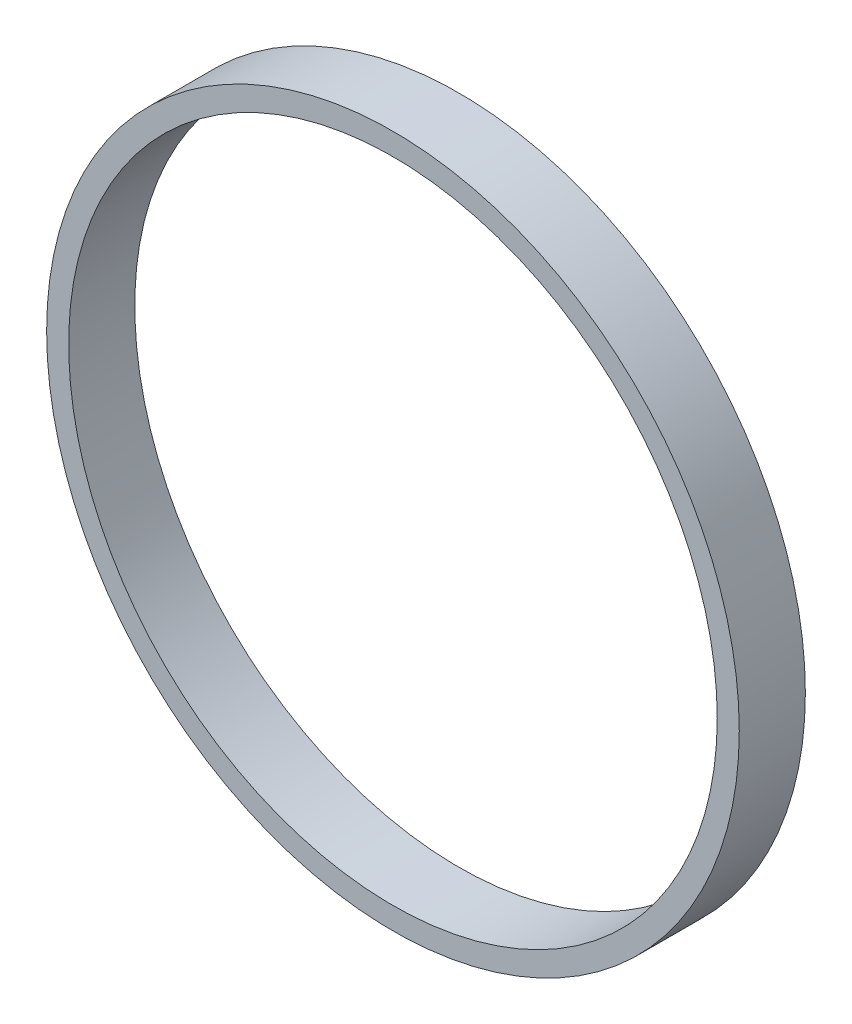
ISO-10303-21;
HEADER;
FILE_DESCRIPTION(('STEP AP214'),'2;1');
FILE_NAME('part.step','',(''),(''),'','','');
FILE_SCHEMA(('AUTOMOTIVE_DESIGN { 1 0 10303 214 1 1 1 1 }'));
ENDSEC;
DATA;
#1=APPLICATION_CONTEXT('core data for automotive mechanical design processes');
#2=APPLICATION_PROTOCOL_DEFINITION('international standard','automotive_design',2000,#1);
#3=PRODUCT_CONTEXT('',#1,'mechanical');
#4=PRODUCT('Part','Part','',(#3));
#5=PRODUCT_RELATED_PRODUCT_CATEGORY('part','',(#4));
#6=PRODUCT_DEFINITION_FORMATION('','',#4);
#7=PRODUCT_DEFINITION_CONTEXT('part definition',#1,'design');
#8=PRODUCT_DEFINITION('design','',#6,#7);
#9=PRODUCT_DEFINITION_SHAPE('','',#8);
#10=(LENGTH_UNIT() NAMED_UNIT(*) SI_UNIT(.MILLI.,.METRE.));
#11=(NAMED_UNIT(*) PLANE_ANGLE_UNIT() SI_UNIT($,.RADIAN.));
#12=(NAMED_UNIT(*) SI_UNIT($,.STERADIAN.) SOLID_ANGLE_UNIT());
#13=UNCERTAINTY_MEASURE_WITH_UNIT(LENGTH_MEASURE(1.E-05),#10,'distance_accuracy_value','');
#14=(GEOMETRIC_REPRESENTATION_CONTEXT(3) GLOBAL_UNCERTAINTY_ASSIGNED_CONTEXT((#13)) GLOBAL_UNIT_ASSIGNED_CONTEXT((#10,
#11,#12)) REPRESENTATION_CONTEXT('',''));
#15=CARTESIAN_POINT('',(0.,0.,0.));
#16=DIRECTION('',(0.,0.,1.));
#17=DIRECTION('',(1.,0.,0.));
#18=AXIS2_PLACEMENT_3D('',#15,#16,#17);
#19=CARTESIAN_POINT('',(0.,0.,4.7625));
#20=DIRECTION('',(0.,0.,1.));
#21=DIRECTION('',(1.,0.,0.));
#22=AXIS2_PLACEMENT_3D('',#19,#20,#21);
#23=PLANE('',#22);
#24=CARTESIAN_POINT('',(0.,0.,4.7625));
#25=DIRECTION('',(0.,0.,1.));
#26=DIRECTION('',(1.,0.,0.));
#27=AXIS2_PLACEMENT_3D('',#24,#25,#26);
#28=CIRCLE('',#27,24.9555);
#29=CARTESIAN_POINT('',(24.9555,0.,4.7625));
#30=VERTEX_POINT('',#29);
#31=EDGE_CURVE('E10',#30,#30,#28,.T.);
#32=ORIENTED_EDGE('',*,*,#31,.T.);
#33=EDGE_LOOP('',(#32));
#34=FACE_BOUND('',#33,.T.);
#35=CARTESIAN_POINT('',(0.,0.,4.7625));
#36=DIRECTION('',(0.,0.,1.));
#37=DIRECTION('',(1.,0.,0.));
#38=AXIS2_PLACEMENT_3D('',#35,#36,#37);
#39=CIRCLE('',#38,23.368);
#40=CARTESIAN_POINT('',(23.368,0.,4.7625));
#41=VERTEX_POINT('',#40);
#42=EDGE_CURVE('E39',#41,#41,#39,.T.);
#43=ORIENTED_EDGE('',*,*,#42,.F.);
#44=EDGE_LOOP('',(#43));
#45=FACE_BOUND('',#44,.T.);
#46=ADVANCED_FACE('F28',(#34,#45),#23,.T.);
#47=CARTESIAN_POINT('',(0.,0.,0.));
#48=DIRECTION('',(0.,0.,1.));
#49=DIRECTION('',(1.,0.,0.));
#50=AXIS2_PLACEMENT_3D('',#47,#48,#49);
#51=PLANE('',#50);
#52=CARTESIAN_POINT('',(0.,0.,0.));
#53=DIRECTION('',(0.,0.,1.));
#54=DIRECTION('',(1.,0.,0.));
#55=AXIS2_PLACEMENT_3D('',#52,#53,#54);
#56=CIRCLE('',#55,24.9555);
#57=CARTESIAN_POINT('',(24.9555,0.,0.));
#58=VERTEX_POINT('',#57);
#59=EDGE_CURVE('E32',#58,#58,#56,.T.);
#60=ORIENTED_EDGE('',*,*,#59,.F.);
#61=EDGE_LOOP('',(#60));
#62=FACE_BOUND('',#61,.T.);
#63=CARTESIAN_POINT('',(0.,0.,0.));
#64=DIRECTION('',(0.,0.,1.));
#65=DIRECTION('',(1.,0.,0.));
#66=AXIS2_PLACEMENT_3D('',#63,#64,#65);
#67=CIRCLE('',#66,23.368);
#68=CARTESIAN_POINT('',(23.368,0.,0.));
#69=VERTEX_POINT('',#68);
#70=EDGE_CURVE('E41',#69,#69,#67,.T.);
#71=ORIENTED_EDGE('',*,*,#70,.T.);
#72=EDGE_LOOP('',(#71));
#73=FACE_BOUND('',#72,.T.);
#74=ADVANCED_FACE('F51',(#62,#73),#51,.F.);
#75=CARTESIAN_POINT('',(0.,0.,4.7625));
#76=DIRECTION('',(0.,0.,-1.));
#77=DIRECTION('',(-1.,0.,0.));
#78=AXIS2_PLACEMENT_3D('',#75,#76,#77);
#79=CYLINDRICAL_SURFACE('',#78,24.9555);
#80=ORIENTED_EDGE('',*,*,#31,.F.);
#81=EDGE_LOOP('',(#80));
#82=FACE_BOUND('',#81,.T.);
#83=ORIENTED_EDGE('',*,*,#59,.T.);
#84=EDGE_LOOP('',(#83));
#85=FACE_BOUND('',#84,.T.);
#86=ADVANCED_FACE('F30',(#82,#85),#79,.T.);
#87=CARTESIAN_POINT('',(0.,0.,4.7625));
#88=DIRECTION('',(0.,0.,-1.));
#89=DIRECTION('',(-1.,0.,0.));
#90=AXIS2_PLACEMENT_3D('',#87,#88,#89);
#91=CYLINDRICAL_SURFACE('',#90,23.368);
#92=ORIENTED_EDGE('',*,*,#42,.T.);
#93=EDGE_LOOP('',(#92));
#94=FACE_BOUND('',#93,.T.);
#95=ORIENTED_EDGE('',*,*,#70,.F.);
#96=EDGE_LOOP('',(#95));
#97=FACE_BOUND('',#96,.T.);
#98=ADVANCED_FACE('F47',(#94,#97),#91,.F.);
#99=CLOSED_SHELL('',(#46,#74,#86,#98));
#100=MANIFOLD_SOLID_BREP('B2',#99);
#101=ADVANCED_BREP_SHAPE_REPRESENTATION('',(#18,#100),#14);
#102=SHAPE_DEFINITION_REPRESENTATION(#9,#101);
ENDSEC;
END-ISO-10303-21;
